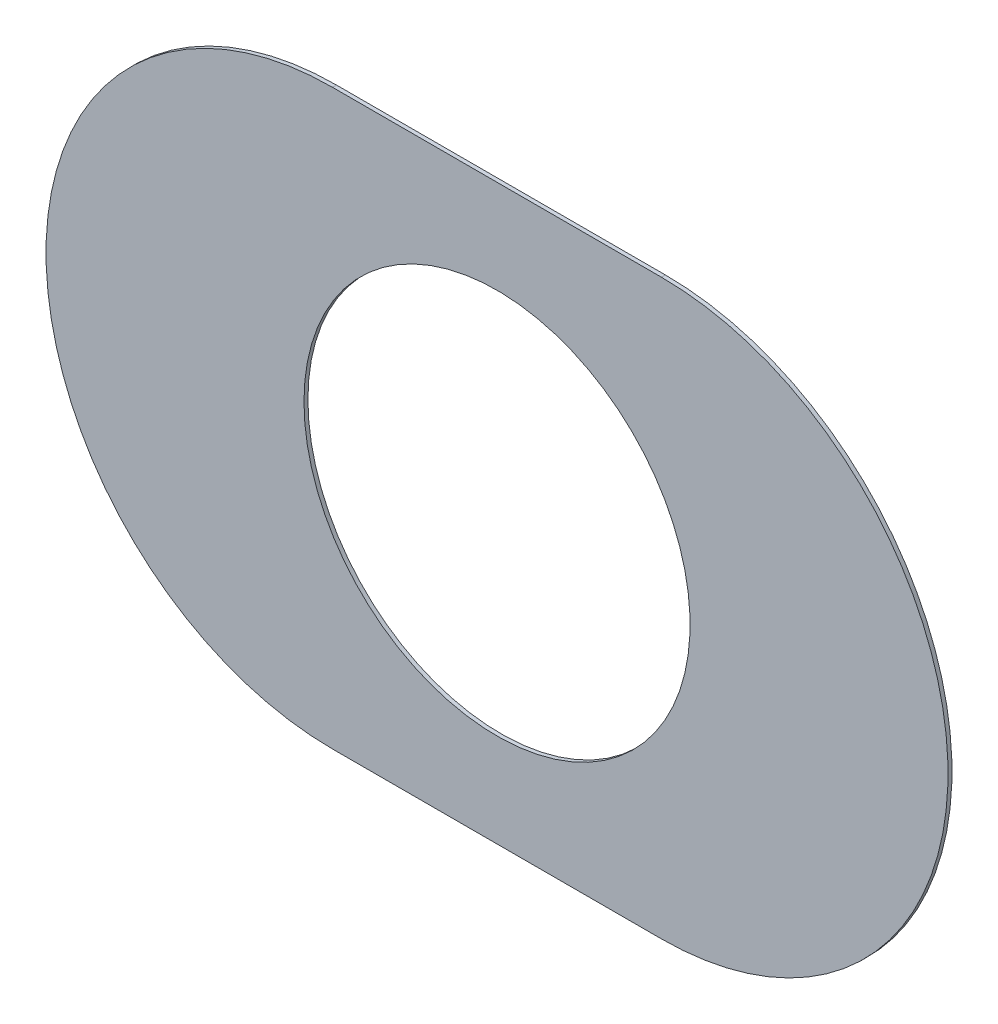
ISO-10303-21;
HEADER;
FILE_DESCRIPTION(('STEP AP214'),'2;1');
FILE_NAME('part.step','',(''),(''),'','','');
FILE_SCHEMA(('AUTOMOTIVE_DESIGN { 1 0 10303 214 1 1 1 1 }'));
ENDSEC;
DATA;
#1=APPLICATION_CONTEXT('core data for automotive mechanical design processes');
#2=APPLICATION_PROTOCOL_DEFINITION('international standard','automotive_design',2000,#1);
#3=PRODUCT_CONTEXT('',#1,'mechanical');
#4=PRODUCT('Part','Part','',(#3));
#5=PRODUCT_RELATED_PRODUCT_CATEGORY('part','',(#4));
#6=PRODUCT_DEFINITION_FORMATION('','',#4);
#7=PRODUCT_DEFINITION_CONTEXT('part definition',#1,'design');
#8=PRODUCT_DEFINITION('design','',#6,#7);
#9=PRODUCT_DEFINITION_SHAPE('','',#8);
#10=(LENGTH_UNIT() NAMED_UNIT(*) SI_UNIT(.MILLI.,.METRE.));
#11=(NAMED_UNIT(*) PLANE_ANGLE_UNIT() SI_UNIT($,.RADIAN.));
#12=(NAMED_UNIT(*) SI_UNIT($,.STERADIAN.) SOLID_ANGLE_UNIT());
#13=UNCERTAINTY_MEASURE_WITH_UNIT(LENGTH_MEASURE(1.E-05),#10,'distance_accuracy_value','');
#14=(GEOMETRIC_REPRESENTATION_CONTEXT(3) GLOBAL_UNCERTAINTY_ASSIGNED_CONTEXT((#13)) GLOBAL_UNIT_ASSIGNED_CONTEXT((#10,
#11,#12)) REPRESENTATION_CONTEXT('',''));
#15=CARTESIAN_POINT('',(0.,0.,0.));
#16=DIRECTION('',(0.,0.,1.));
#17=DIRECTION('',(1.,0.,0.));
#18=AXIS2_PLACEMENT_3D('',#15,#16,#17);
#19=CARTESIAN_POINT('',(1.54999965727325,24.7000006854535,0.));
#20=DIRECTION('',(0.,0.,-1.));
#21=DIRECTION('',(0.,-1.,0.));
#22=AXIS2_PLACEMENT_3D('',#19,#20,#21);
#23=PLANE('',#22);
#24=CARTESIAN_POINT('',(1.54999965727325,24.7000006854535,0.));
#25=DIRECTION('',(0.,0.,1.));
#26=DIRECTION('',(1.,0.,0.));
#27=AXIS2_PLACEMENT_3D('',#24,#25,#26);
#28=CIRCLE('',#27,0.49);
#29=CARTESIAN_POINT('',(1.05999965727325,24.7000006854535,0.));
#30=VERTEX_POINT('',#29);
#31=EDGE_CURVE('E79',#30,#30,#28,.T.);
#32=ORIENTED_EDGE('',*,*,#31,.F.);
#33=EDGE_LOOP('',(#32));
#34=FACE_BOUND('',#33,.T.);
#35=CARTESIAN_POINT('',(1.96740611181985,24.7000006854535,0.));
#36=DIRECTION('',(0.,0.,-1.));
#37=DIRECTION('',(0.,1.,0.));
#38=AXIS2_PLACEMENT_3D('',#35,#36,#37);
#39=CIRCLE('',#38,0.727257121659981);
#40=CARTESIAN_POINT('',(1.96740611181985,25.4272578071135,0.));
#41=VERTEX_POINT('',#40);
#42=CARTESIAN_POINT('',(1.96740611181985,23.9727435637935,0.));
#43=VERTEX_POINT('',#42);
#44=EDGE_CURVE('E28',#41,#43,#39,.T.);
#45=ORIENTED_EDGE('',*,*,#44,.F.);
#46=DIRECTION('',(1.,0.,0.));
#47=VECTOR('',#46,1.);
#48=CARTESIAN_POINT('',(1.13259320272665,25.4272578071135,0.));
#49=LINE('',#48,#47);
#50=CARTESIAN_POINT('',(1.13259320272665,25.4272578071135,0.));
#51=VERTEX_POINT('',#50);
#52=EDGE_CURVE('E104',#51,#41,#49,.T.);
#53=ORIENTED_EDGE('',*,*,#52,.F.);
#54=CARTESIAN_POINT('',(1.13259320272665,24.7000006854535,0.));
#55=DIRECTION('',(0.,0.,-1.));
#56=DIRECTION('',(0.,-1.,0.));
#57=AXIS2_PLACEMENT_3D('',#54,#55,#56);
#58=CIRCLE('',#57,0.727257121659981);
#59=CARTESIAN_POINT('',(1.13259320272665,23.9727435637935,0.));
#60=VERTEX_POINT('',#59);
#61=EDGE_CURVE('E21',#60,#51,#58,.T.);
#62=ORIENTED_EDGE('',*,*,#61,.F.);
#63=DIRECTION('',(-1.,0.,0.));
#64=VECTOR('',#63,1.);
#65=CARTESIAN_POINT('',(1.96740611181985,23.9727435637935,0.));
#66=LINE('',#65,#64);
#67=EDGE_CURVE('E89',#43,#60,#66,.T.);
#68=ORIENTED_EDGE('',*,*,#67,.F.);
#69=EDGE_LOOP('',(#45,#53,#62,#68));
#70=FACE_BOUND('',#69,.T.);
#71=ADVANCED_FACE('F17',(#34,#70),#23,.F.);
#72=CARTESIAN_POINT('',(1.54999965727325,24.7000006854535,-0.01));
#73=DIRECTION('',(0.,0.,-1.));
#74=DIRECTION('',(0.,-1.,0.));
#75=AXIS2_PLACEMENT_3D('',#72,#73,#74);
#76=PLANE('',#75);
#77=CARTESIAN_POINT('',(1.54999965727325,24.7000006854535,-0.01));
#78=DIRECTION('',(0.,0.,1.));
#79=DIRECTION('',(1.,0.,0.));
#80=AXIS2_PLACEMENT_3D('',#77,#78,#79);
#81=CIRCLE('',#80,0.49);
#82=CARTESIAN_POINT('',(1.05999965727325,24.7000006854535,-0.01));
#83=VERTEX_POINT('',#82);
#84=EDGE_CURVE('E77',#83,#83,#81,.T.);
#85=ORIENTED_EDGE('',*,*,#84,.T.);
#86=EDGE_LOOP('',(#85));
#87=FACE_BOUND('',#86,.T.);
#88=CARTESIAN_POINT('',(1.96740611181985,24.7000006854535,-0.01));
#89=DIRECTION('',(0.,0.,-1.));
#90=DIRECTION('',(0.,1.,0.));
#91=AXIS2_PLACEMENT_3D('',#88,#89,#90);
#92=CIRCLE('',#91,0.727257121659981);
#93=CARTESIAN_POINT('',(1.96740611181985,25.4272578071135,-0.01));
#94=VERTEX_POINT('',#93);
#95=CARTESIAN_POINT('',(1.96740611181985,23.9727435637935,-0.01));
#96=VERTEX_POINT('',#95);
#97=EDGE_CURVE('E11',#94,#96,#92,.T.);
#98=ORIENTED_EDGE('',*,*,#97,.T.);
#99=DIRECTION('',(-1.,0.,0.));
#100=VECTOR('',#99,1.);
#101=CARTESIAN_POINT('',(1.96740611181985,23.9727435637935,-0.01));
#102=LINE('',#101,#100);
#103=CARTESIAN_POINT('',(1.13259320272665,23.9727435637935,-0.01));
#104=VERTEX_POINT('',#103);
#105=EDGE_CURVE('E90',#96,#104,#102,.T.);
#106=ORIENTED_EDGE('',*,*,#105,.T.);
#107=CARTESIAN_POINT('',(1.13259320272665,24.7000006854535,-0.01));
#108=DIRECTION('',(0.,0.,-1.));
#109=DIRECTION('',(0.,-1.,0.));
#110=AXIS2_PLACEMENT_3D('',#107,#108,#109);
#111=CIRCLE('',#110,0.727257121659981);
#112=CARTESIAN_POINT('',(1.13259320272665,25.4272578071135,-0.01));
#113=VERTEX_POINT('',#112);
#114=EDGE_CURVE('E131',#104,#113,#111,.T.);
#115=ORIENTED_EDGE('',*,*,#114,.T.);
#116=DIRECTION('',(1.,0.,0.));
#117=VECTOR('',#116,1.);
#118=CARTESIAN_POINT('',(1.13259320272665,25.4272578071135,-0.01));
#119=LINE('',#118,#117);
#120=EDGE_CURVE('E92',#113,#94,#119,.T.);
#121=ORIENTED_EDGE('',*,*,#120,.T.);
#122=EDGE_LOOP('',(#98,#106,#115,#121));
#123=FACE_BOUND('',#122,.T.);
#124=ADVANCED_FACE('F19',(#87,#123),#76,.T.);
#125=CARTESIAN_POINT('',(1.96740611181985,24.7000006854535,0.));
#126=DIRECTION('',(0.,0.,-1.));
#127=DIRECTION('',(0.,1.,0.));
#128=AXIS2_PLACEMENT_3D('',#125,#126,#127);
#129=CYLINDRICAL_SURFACE('',#128,0.727257121659981);
#130=ORIENTED_EDGE('',*,*,#44,.T.);
#131=DIRECTION('',(0.,0.,-1.));
#132=VECTOR('',#131,1.);
#133=CARTESIAN_POINT('',(1.96740611181985,23.9727435637935,0.));
#134=LINE('',#133,#132);
#135=EDGE_CURVE('E116',#43,#96,#134,.T.);
#136=ORIENTED_EDGE('',*,*,#135,.T.);
#137=ORIENTED_EDGE('',*,*,#97,.F.);
#138=DIRECTION('',(0.,0.,-1.));
#139=VECTOR('',#138,1.);
#140=CARTESIAN_POINT('',(1.96740611181985,25.4272578071135,0.));
#141=LINE('',#140,#139);
#142=EDGE_CURVE('E95',#41,#94,#141,.T.);
#143=ORIENTED_EDGE('',*,*,#142,.F.);
#144=EDGE_LOOP('',(#130,#136,#137,#143));
#145=FACE_BOUND('',#144,.T.);
#146=ADVANCED_FACE('F153',(#145),#129,.T.);
#147=CARTESIAN_POINT('',(1.96740611181985,23.9727435637935,0.));
#148=DIRECTION('',(0.,-1.,0.));
#149=DIRECTION('',(0.,0.,-1.));
#150=AXIS2_PLACEMENT_3D('',#147,#148,#149);
#151=PLANE('',#150);
#152=ORIENTED_EDGE('',*,*,#67,.T.);
#153=DIRECTION('',(0.,0.,-1.));
#154=VECTOR('',#153,1.);
#155=CARTESIAN_POINT('',(1.13259320272665,23.9727435637935,0.));
#156=LINE('',#155,#154);
#157=EDGE_CURVE('E91',#60,#104,#156,.T.);
#158=ORIENTED_EDGE('',*,*,#157,.T.);
#159=ORIENTED_EDGE('',*,*,#105,.F.);
#160=ORIENTED_EDGE('',*,*,#135,.F.);
#161=EDGE_LOOP('',(#152,#158,#159,#160));
#162=FACE_BOUND('',#161,.T.);
#163=ADVANCED_FACE('F135',(#162),#151,.T.);
#164=CARTESIAN_POINT('',(1.13259320272665,24.7000006854535,0.));
#165=DIRECTION('',(0.,0.,-1.));
#166=DIRECTION('',(0.,-1.,0.));
#167=AXIS2_PLACEMENT_3D('',#164,#165,#166);
#168=CYLINDRICAL_SURFACE('',#167,0.727257121659981);
#169=ORIENTED_EDGE('',*,*,#61,.T.);
#170=DIRECTION('',(0.,0.,-1.));
#171=VECTOR('',#170,1.);
#172=CARTESIAN_POINT('',(1.13259320272665,25.4272578071135,0.));
#173=LINE('',#172,#171);
#174=EDGE_CURVE('E94',#51,#113,#173,.T.);
#175=ORIENTED_EDGE('',*,*,#174,.T.);
#176=ORIENTED_EDGE('',*,*,#114,.F.);
#177=ORIENTED_EDGE('',*,*,#157,.F.);
#178=EDGE_LOOP('',(#169,#175,#176,#177));
#179=FACE_BOUND('',#178,.T.);
#180=ADVANCED_FACE('F142',(#179),#168,.T.);
#181=CARTESIAN_POINT('',(1.13259320272665,25.4272578071135,0.));
#182=DIRECTION('',(0.,1.,0.));
#183=DIRECTION('',(1.,0.,0.));
#184=AXIS2_PLACEMENT_3D('',#181,#182,#183);
#185=PLANE('',#184);
#186=ORIENTED_EDGE('',*,*,#52,.T.);
#187=ORIENTED_EDGE('',*,*,#142,.T.);
#188=ORIENTED_EDGE('',*,*,#120,.F.);
#189=ORIENTED_EDGE('',*,*,#174,.F.);
#190=EDGE_LOOP('',(#186,#187,#188,#189));
#191=FACE_BOUND('',#190,.T.);
#192=ADVANCED_FACE('F151',(#191),#185,.T.);
#193=CARTESIAN_POINT('',(1.54999965727325,24.7000006854535,0.));
#194=DIRECTION('',(0.,0.,-1.));
#195=DIRECTION('',(1.,0.,0.));
#196=AXIS2_PLACEMENT_3D('',#193,#194,#195);
#197=CYLINDRICAL_SURFACE('',#196,0.49);
#198=ORIENTED_EDGE('',*,*,#84,.F.);
#199=DIRECTION('',(0.,0.,1.));
#200=VECTOR('',#199,1.);
#201=CARTESIAN_POINT('',(1.05999965727325,24.7000006854535,0.));
#202=LINE('',#201,#200);
#203=EDGE_CURVE('E74',#83,#30,#202,.T.);
#204=ORIENTED_EDGE('',*,*,#203,.T.);
#205=ORIENTED_EDGE('',*,*,#31,.T.);
#206=ORIENTED_EDGE('',*,*,#203,.F.);
#207=EDGE_LOOP('',(#198,#204,#205,#206));
#208=FACE_BOUND('',#207,.T.);
#209=ADVANCED_FACE('F76',(#208),#197,.F.);
#210=CLOSED_SHELL('',(#71,#124,#146,#163,#180,#192,#209));
#211=MANIFOLD_SOLID_BREP('B1',#210);
#212=ADVANCED_BREP_SHAPE_REPRESENTATION('',(#18,#211),#14);
#213=SHAPE_DEFINITION_REPRESENTATION(#9,#212);
ENDSEC;
END-ISO-10303-21;
